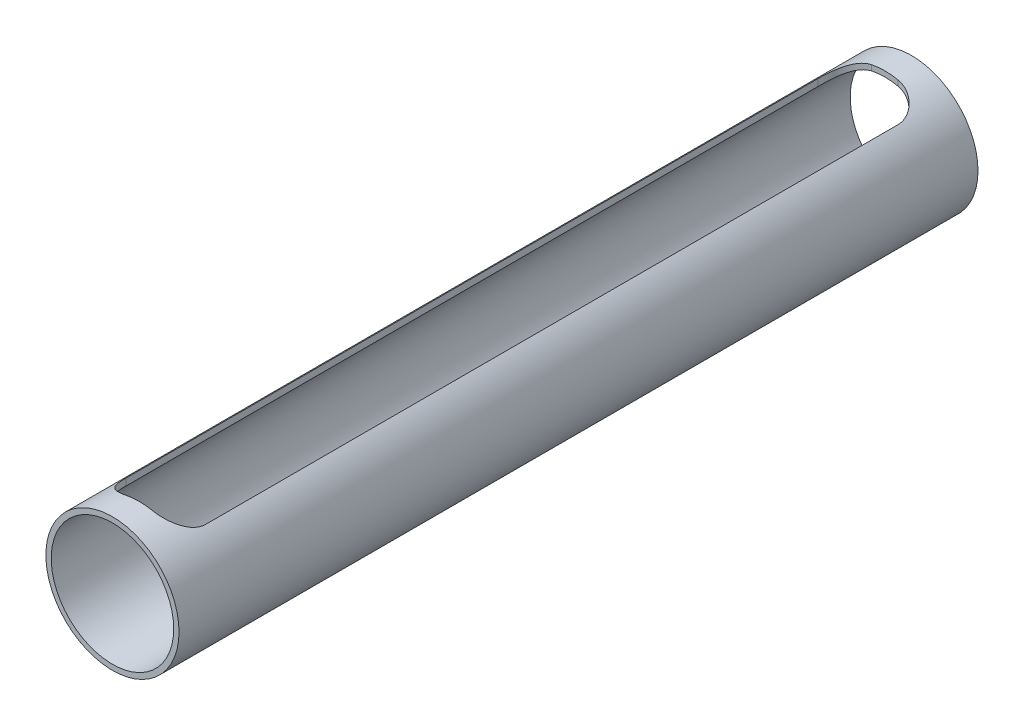
ISO-10303-21;
HEADER;
FILE_DESCRIPTION(('STEP AP214'),'2;1');
FILE_NAME('part.step','',(''),(''),'','','');
FILE_SCHEMA(('AUTOMOTIVE_DESIGN { 1 0 10303 214 1 1 1 1 }'));
ENDSEC;
DATA;
#1=APPLICATION_CONTEXT('core data for automotive mechanical design processes');
#2=APPLICATION_PROTOCOL_DEFINITION('international standard','automotive_design',2000,#1);
#3=PRODUCT_CONTEXT('',#1,'mechanical');
#4=PRODUCT('Part','Part','',(#3));
#5=PRODUCT_RELATED_PRODUCT_CATEGORY('part','',(#4));
#6=PRODUCT_DEFINITION_FORMATION('','',#4);
#7=PRODUCT_DEFINITION_CONTEXT('part definition',#1,'design');
#8=PRODUCT_DEFINITION('design','',#6,#7);
#9=PRODUCT_DEFINITION_SHAPE('','',#8);
#10=(LENGTH_UNIT() NAMED_UNIT(*) SI_UNIT(.MILLI.,.METRE.));
#11=(NAMED_UNIT(*) PLANE_ANGLE_UNIT() SI_UNIT($,.RADIAN.));
#12=(NAMED_UNIT(*) SI_UNIT($,.STERADIAN.) SOLID_ANGLE_UNIT());
#13=UNCERTAINTY_MEASURE_WITH_UNIT(LENGTH_MEASURE(1.E-05),#10,'distance_accuracy_value','');
#14=(GEOMETRIC_REPRESENTATION_CONTEXT(3) GLOBAL_UNCERTAINTY_ASSIGNED_CONTEXT((#13)) GLOBAL_UNIT_ASSIGNED_CONTEXT((#10,
#11,#12)) REPRESENTATION_CONTEXT('',''));
#15=CARTESIAN_POINT('',(0.,0.,0.));
#16=DIRECTION('',(0.,0.,1.));
#17=DIRECTION('',(1.,0.,0.));
#18=AXIS2_PLACEMENT_3D('',#15,#16,#17);
#19=CARTESIAN_POINT('',(0.,0.,300.));
#20=DIRECTION('',(0.,0.,1.));
#21=DIRECTION('',(1.,0.,0.));
#22=AXIS2_PLACEMENT_3D('',#19,#20,#21);
#23=PLANE('',#22);
#24=CARTESIAN_POINT('',(0.,0.,300.));
#25=DIRECTION('',(0.,0.,1.));
#26=DIRECTION('',(1.,0.,0.));
#27=AXIS2_PLACEMENT_3D('',#24,#25,#26);
#28=CIRCLE('',#27,25.);
#29=CARTESIAN_POINT('',(25.,0.,300.));
#30=VERTEX_POINT('',#29);
#31=EDGE_CURVE('E107',#30,#30,#28,.T.);
#32=ORIENTED_EDGE('',*,*,#31,.T.);
#33=EDGE_LOOP('',(#32));
#34=FACE_BOUND('',#33,.T.);
#35=CARTESIAN_POINT('',(0.,0.,300.));
#36=DIRECTION('',(0.,0.,1.));
#37=DIRECTION('',(1.,0.,0.));
#38=AXIS2_PLACEMENT_3D('',#35,#36,#37);
#39=CIRCLE('',#38,23.);
#40=CARTESIAN_POINT('',(23.,0.,300.));
#41=VERTEX_POINT('',#40);
#42=EDGE_CURVE('E167',#41,#41,#39,.T.);
#43=ORIENTED_EDGE('',*,*,#42,.F.);
#44=EDGE_LOOP('',(#43));
#45=FACE_BOUND('',#44,.T.);
#46=ADVANCED_FACE('F33',(#34,#45),#23,.T.);
#47=CARTESIAN_POINT('',(0.,0.,0.));
#48=DIRECTION('',(0.,0.,1.));
#49=DIRECTION('',(1.,0.,0.));
#50=AXIS2_PLACEMENT_3D('',#47,#48,#49);
#51=PLANE('',#50);
#52=CARTESIAN_POINT('',(0.,0.,0.));
#53=DIRECTION('',(0.,0.,1.));
#54=DIRECTION('',(1.,0.,0.));
#55=AXIS2_PLACEMENT_3D('',#52,#53,#54);
#56=CIRCLE('',#55,25.);
#57=CARTESIAN_POINT('',(25.,0.,0.));
#58=VERTEX_POINT('',#57);
#59=EDGE_CURVE('E260',#58,#58,#56,.T.);
#60=ORIENTED_EDGE('',*,*,#59,.F.);
#61=EDGE_LOOP('',(#60));
#62=FACE_BOUND('',#61,.T.);
#63=CARTESIAN_POINT('',(0.,0.,0.));
#64=DIRECTION('',(0.,0.,1.));
#65=DIRECTION('',(1.,0.,0.));
#66=AXIS2_PLACEMENT_3D('',#63,#64,#65);
#67=CIRCLE('',#66,23.);
#68=CARTESIAN_POINT('',(23.,0.,0.));
#69=VERTEX_POINT('',#68);
#70=EDGE_CURVE('E166',#69,#69,#67,.T.);
#71=ORIENTED_EDGE('',*,*,#70,.T.);
#72=EDGE_LOOP('',(#71));
#73=FACE_BOUND('',#72,.T.);
#74=ADVANCED_FACE('F249',(#62,#73),#51,.F.);
#75=CARTESIAN_POINT('',(0.,0.,300.));
#76=DIRECTION('',(0.,0.,-1.));
#77=DIRECTION('',(-1.,0.,0.));
#78=AXIS2_PLACEMENT_3D('',#75,#76,#77);
#79=CYLINDRICAL_SURFACE('',#78,25.);
#80=CARTESIAN_POINT('',(0.,0.,10.));
#81=DIRECTION('',(0.,0.,-1.));
#82=DIRECTION('',(-1.,0.,0.));
#83=AXIS2_PLACEMENT_3D('',#80,#81,#82);
#84=CIRCLE('',#83,25.);
#85=CARTESIAN_POINT('',(-5.00000000000002,24.4948974278318,10.));
#86=VERTEX_POINT('',#85);
#87=CARTESIAN_POINT('',(5.00000000000002,24.4948974278318,10.));
#88=VERTEX_POINT('',#87);
#89=EDGE_CURVE('E198',#86,#88,#84,.T.);
#90=ORIENTED_EDGE('',*,*,#89,.T.);
#91=CARTESIAN_POINT('',(5.00000000000002,24.4948974278318,10.));
#92=CARTESIAN_POINT('',(5.14303837233241,24.4657016129685,9.99999958017287));
#93=CARTESIAN_POINT('',(5.28579840553904,24.4352535390066,10.0030694771409));
#94=CARTESIAN_POINT('',(5.57050621819225,24.3719247231988,10.0152703718325));
#95=CARTESIAN_POINT('',(5.71245406147975,24.3390441754643,10.0244008863814));
#96=CARTESIAN_POINT('',(6.1364918362658,24.2369116953102,10.0607443924561));
#97=CARTESIAN_POINT('',(6.41701786765221,24.1641194908536,10.0969096213806));
#98=CARTESIAN_POINT('',(6.9703174317055,24.0103473454274,10.1920284836991));
#99=CARTESIAN_POINT('',(7.24312200483371,23.9294088971209,10.2508705608199));
#100=CARTESIAN_POINT('',(7.78073976953116,23.7600404327401,10.3903894782287));
#101=CARTESIAN_POINT('',(8.04555184459905,23.6716093765051,10.4710693535707));
#102=CARTESIAN_POINT('',(8.5649701353708,23.4886552534443,10.6529935944866));
#103=CARTESIAN_POINT('',(8.81960081416304,23.3941484146467,10.7541846165521));
#104=CARTESIAN_POINT('',(9.31822803392014,23.2000482701,10.976284966447));
#105=CARTESIAN_POINT('',(9.56221989418785,23.1004527665486,11.097202864643));
#106=CARTESIAN_POINT('',(10.0386939069366,22.8974186874217,11.3579273914724));
#107=CARTESIAN_POINT('',(10.271160035536,22.7939750931414,11.4977593622102));
#108=CARTESIAN_POINT('',(10.7232829853869,22.584801468626,11.7952893102386));
#109=CARTESIAN_POINT('',(10.9429390272002,22.4790712997983,11.9529883729498));
#110=CARTESIAN_POINT('',(11.3860163262992,22.2581406296398,12.2990800013817));
#111=CARTESIAN_POINT('',(11.6082690760545,22.1428745609543,12.4889291089619));
#112=CARTESIAN_POINT('',(12.03566002025,21.9135054184813,12.8876923888925));
#113=CARTESIAN_POINT('',(12.2407963967709,21.7994024693548,13.0966085814246));
#114=CARTESIAN_POINT('',(12.6327218282886,21.5746461209196,13.5325853240966));
#115=CARTESIAN_POINT('',(12.8195167910652,21.4639916187552,13.7596399888058));
#116=CARTESIAN_POINT('',(13.1735981336548,21.248512130273,14.2311853933548));
#117=CARTESIAN_POINT('',(13.3408815583788,21.1436880282438,14.4756787653334));
#118=CARTESIAN_POINT('',(13.6293552345481,20.9586540257833,14.9406866128472));
#119=CARTESIAN_POINT('',(13.7536389836998,20.8771880927823,15.1587863292708));
#120=CARTESIAN_POINT('',(13.9864094522994,20.7219671002349,15.6059182509894));
#121=CARTESIAN_POINT('',(14.0948968058377,20.6482117312086,15.8349500169656));
#122=CARTESIAN_POINT('',(14.2947752278168,20.5103417158092,16.3024827900333));
#123=CARTESIAN_POINT('',(14.38620646402,20.446204490122,16.5409599036878));
#124=CARTESIAN_POINT('',(14.5511580590982,20.3291426508016,17.0266047122386));
#125=CARTESIAN_POINT('',(14.6246880203533,20.2762120278564,17.2737676661968));
#126=CARTESIAN_POINT('',(14.7396957126372,20.1927048502555,17.7238881378177));
#127=CARTESIAN_POINT('',(14.784653879181,20.1597701812266,17.9255259764396));
#128=CARTESIAN_POINT('',(14.8621451451004,20.1027099666487,18.3323772713636));
#129=CARTESIAN_POINT('',(14.8946810100734,20.0785824603993,18.5375899211495));
#130=CARTESIAN_POINT('',(14.9470909281765,20.0396010515749,18.9516159614858));
#131=CARTESIAN_POINT('',(14.9668972876382,20.0247967366297,19.1604426354732));
#132=CARTESIAN_POINT('',(14.9933699774573,20.0049720004956,19.5795054223523));
#133=CARTESIAN_POINT('',(15.0000288297816,19.9999571473706,19.7897422691546));
#134=CARTESIAN_POINT('',(15.,20.,20.));
#135=B_SPLINE_CURVE_WITH_KNOTS('',3,(#91,#92,#93,#94,#95,#96,#97,#98,#99,#100,#101,#102,#103,
#104,#105,#106,#107,#108,#109,#110,#111,#112,#113,#114,#115,#116,#117,#118,#119,#120,#121,#122,
#123,#124,#125,#126,#127,#128,#129,#130,#131,#132,#133,#134),.UNSPECIFIED.,.F.,.F.,(4,2,2,2,2,2,
2,2,2,2,2,2,2,2,2,2,2,2,2,2,2,4),(0.,0.437882162683755,0.875729419986846,1.75068606058833,
2.62139228664386,3.49221958710982,4.36081052651778,5.22977983623795,6.09992518940482,
6.97012343202207,7.91168569841341,8.8533478405804,9.79470567096022,10.7362058885792,
11.5271988598179,12.3181600706838,13.1072343513313,13.8958844293072,14.5229334609037,
15.1498428100273,15.7800589748626,16.4106334906159),.UNSPECIFIED.);
#136=CARTESIAN_POINT('',(15.,20.,20.));
#137=VERTEX_POINT('',#136);
#138=EDGE_CURVE('E114',#88,#137,#135,.T.);
#139=ORIENTED_EDGE('',*,*,#138,.T.);
#140=DIRECTION('',(0.,0.,-1.));
#141=VECTOR('',#140,1.);
#142=CARTESIAN_POINT('',(15.,20.,300.));
#143=LINE('',#142,#141);
#144=CARTESIAN_POINT('',(15.,20.,280.));
#145=VERTEX_POINT('',#144);
#146=EDGE_CURVE('E156',#137,#145,#143,.F.);
#147=ORIENTED_EDGE('',*,*,#146,.T.);
#148=CARTESIAN_POINT('',(15.,20.,280.));
#149=CARTESIAN_POINT('',(15.0000014145047,19.9999968954437,280.124721484722));
#150=CARTESIAN_POINT('',(14.9976660979272,20.0017506712033,280.249424248617));
#151=CARTESIAN_POINT('',(14.9883423273526,20.0087391873832,280.498551168648));
#152=CARTESIAN_POINT('',(14.9813541343986,20.0139737325199,280.622975340022));
#153=CARTESIAN_POINT('',(14.9534600064335,20.0348349160065,280.995226677234));
#154=CARTESIAN_POINT('',(14.9256244295562,20.0556192418498,281.242297389089));
#155=CARTESIAN_POINT('',(14.8522215222555,20.1100363728512,281.730380253627));
#156=CARTESIAN_POINT('',(14.8067884510388,20.1435718589834,281.971423909512));
#157=CARTESIAN_POINT('',(14.6988821377204,20.2224460678486,282.447717962918));
#158=CARTESIAN_POINT('',(14.6364062166432,20.26778664618,282.682967443306));
#159=CARTESIAN_POINT('',(14.4954772870136,20.3688146356706,283.145500126849));
#160=CARTESIAN_POINT('',(14.417074611833,20.4244694034313,283.372805845804));
#161=CARTESIAN_POINT('',(14.2451104877818,20.5447769323076,283.819053948814));
#162=CARTESIAN_POINT('',(14.1515493318394,20.6094295195423,284.037996494382));
#163=CARTESIAN_POINT('',(13.8490123306613,20.8149989591605,284.68186215836));
#164=CARTESIAN_POINT('',(13.6183547449344,20.9674004431704,285.093268198047));
#165=CARTESIAN_POINT('',(13.2206342793677,21.2189326600331,285.699849481737));
#166=CARTESIAN_POINT('',(13.0710400281106,21.3115359078307,285.909681012195));
#167=CARTESIAN_POINT('',(12.7571019781919,21.5009281709953,286.316108149362));
#168=CARTESIAN_POINT('',(12.5927576811342,21.5977173277446,286.512703308429));
#169=CARTESIAN_POINT('',(12.2501211772858,21.7938875059866,286.892107292262));
#170=CARTESIAN_POINT('',(12.0718222079174,21.8932697683783,287.074909347412));
#171=CARTESIAN_POINT('',(11.7020973667655,22.0931002575379,287.42609542984));
#172=CARTESIAN_POINT('',(11.5106709367638,22.1935485294819,287.594478843309));
#173=CARTESIAN_POINT('',(11.0839849175088,22.4100697123571,287.941810412376));
#174=CARTESIAN_POINT('',(10.8465943677183,22.5260884083215,288.118183832296));
#175=CARTESIAN_POINT('',(10.3562781588829,22.7556760959751,288.44972633024));
#176=CARTESIAN_POINT('',(10.1033506365082,22.8692447916234,288.604892857723));
#177=CARTESIAN_POINT('',(9.58349049831765,23.0919158359936,288.892681515329));
#178=CARTESIAN_POINT('',(9.3165729524784,23.2010227741116,289.025327277087));
#179=CARTESIAN_POINT('',(8.76993052845609,23.4131209147418,289.266978795728));
#180=CARTESIAN_POINT('',(8.49020758688139,23.5161130366448,289.37598811303));
#181=CARTESIAN_POINT('',(7.95185215743926,23.7031608989012,289.55813511297));
#182=CARTESIAN_POINT('',(7.694404511469,23.7880417265185,289.633933357018));
#183=CARTESIAN_POINT('',(7.17216353122691,23.9506758371819,289.764945875837));
#184=CARTESIAN_POINT('',(6.90737174964135,24.0284306120687,289.820164466421));
#185=CARTESIAN_POINT('',(6.37106946940391,24.1761645896727,289.909301406677));
#186=CARTESIAN_POINT('',(6.09953903304292,24.246116194249,289.943146012568));
#187=CARTESIAN_POINT('',(5.55235113673325,24.3772676477746,289.988518723356));
#188=CARTESIAN_POINT('',(5.27669112467908,24.4384618153911,290.000032401445));
#189=CARTESIAN_POINT('',(5.00000000000006,24.4948974278318,290.));
#190=B_SPLINE_CURVE_WITH_KNOTS('',3,(#148,#149,#150,#151,#152,#153,#154,#155,#156,#157,#158,
#159,#160,#161,#162,#163,#164,#165,#166,#167,#168,#169,#170,#171,#172,#173,#174,#175,#176,#177,
#178,#179,#180,#181,#182,#183,#184,#185,#186,#187,#188,#189),.UNSPECIFIED.,.F.,.F.,(4,2,2,2,2,2,
2,2,2,2,2,2,2,2,2,2,2,2,2,2,4),(0.,0.374093401240721,0.748165816273225,1.49551959520637,
2.23728035614158,2.97915778214376,3.71872613996171,4.45828020778205,5.93915461910859,
6.76007622284715,7.58102557553641,8.40237526186057,9.22375989607038,10.1756993590541,
11.1277532106871,12.0788017884474,13.0297070076515,13.8732439347355,14.7166038618517,
15.5628578483541,16.409658372012),.UNSPECIFIED.);
#191=CARTESIAN_POINT('',(5.00000000000006,24.4948974278318,290.));
#192=VERTEX_POINT('',#191);
#193=EDGE_CURVE('E148',#145,#192,#190,.T.);
#194=ORIENTED_EDGE('',*,*,#193,.T.);
#195=CARTESIAN_POINT('',(0.,0.,290.));
#196=DIRECTION('',(0.,0.,1.));
#197=DIRECTION('',(1.,0.,0.));
#198=AXIS2_PLACEMENT_3D('',#195,#196,#197);
#199=CIRCLE('',#198,25.);
#200=CARTESIAN_POINT('',(-4.99999999999996,24.4948974278318,290.));
#201=VERTEX_POINT('',#200);
#202=EDGE_CURVE('E157',#192,#201,#199,.T.);
#203=ORIENTED_EDGE('',*,*,#202,.T.);
#204=CARTESIAN_POINT('',(-4.99999999999996,24.4948974278318,290.));
#205=CARTESIAN_POINT('',(-5.14303837233234,24.4657016129685,290.000000419827));
#206=CARTESIAN_POINT('',(-5.28579840553897,24.4352535390066,289.996930522859));
#207=CARTESIAN_POINT('',(-5.57050621819218,24.3719247231988,289.984729628168));
#208=CARTESIAN_POINT('',(-5.71245406147968,24.3390441754643,289.975599113619));
#209=CARTESIAN_POINT('',(-6.13649183626573,24.2369116953102,289.939255607544));
#210=CARTESIAN_POINT('',(-6.41701786765214,24.1641194908537,289.903090378619));
#211=CARTESIAN_POINT('',(-6.97031743170543,24.0103473454275,289.807971516301));
#212=CARTESIAN_POINT('',(-7.24312200483364,23.9294088971209,289.74912943918));
#213=CARTESIAN_POINT('',(-7.78073976953109,23.7600404327401,289.609610521771));
#214=CARTESIAN_POINT('',(-8.04555184459897,23.6716093765051,289.528930646429));
#215=CARTESIAN_POINT('',(-8.56497013537073,23.4886552534443,289.347006405513));
#216=CARTESIAN_POINT('',(-8.81960081416298,23.3941484146467,289.245815383448));
#217=CARTESIAN_POINT('',(-9.31822803392007,23.2000482701,289.023715033553));
#218=CARTESIAN_POINT('',(-9.56221989418776,23.1004527665486,288.902797135357));
#219=CARTESIAN_POINT('',(-10.0386939069365,22.8974186874217,288.642072608528));
#220=CARTESIAN_POINT('',(-10.2711600355359,22.7939750931414,288.50224063779));
#221=CARTESIAN_POINT('',(-10.7232829853868,22.5848014686261,288.204710689761));
#222=CARTESIAN_POINT('',(-10.9429390272001,22.4790712997983,288.04701162705));
#223=CARTESIAN_POINT('',(-11.3860163262991,22.2581406296398,287.700919998618));
#224=CARTESIAN_POINT('',(-11.6082690760545,22.1428745609544,287.511070891038));
#225=CARTESIAN_POINT('',(-12.0356600202499,21.9135054184813,287.112307611107));
#226=CARTESIAN_POINT('',(-12.2407963967708,21.7994024693549,286.903391418575));
#227=CARTESIAN_POINT('',(-12.6327218282885,21.5746461209197,286.467414675903));
#228=CARTESIAN_POINT('',(-12.8195167910651,21.4639916187552,286.240360011194));
#229=CARTESIAN_POINT('',(-13.1735981336547,21.2485121302731,285.768814606645));
#230=CARTESIAN_POINT('',(-13.3408815583787,21.1436880282438,285.524321234667));
#231=CARTESIAN_POINT('',(-13.6293552345481,20.9586540257833,285.059313387153));
#232=CARTESIAN_POINT('',(-13.7536389836998,20.8771880927824,284.841213670729));
#233=CARTESIAN_POINT('',(-13.9864094522993,20.7219671002349,284.394081749011));
#234=CARTESIAN_POINT('',(-14.0948968058376,20.6482117312086,284.165049983034));
#235=CARTESIAN_POINT('',(-14.2947752278167,20.5103417158093,283.697517209967));
#236=CARTESIAN_POINT('',(-14.38620646402,20.446204490122,283.459040096312));
#237=CARTESIAN_POINT('',(-14.5511580590982,20.3291426508016,282.973395287761));
#238=CARTESIAN_POINT('',(-14.6246880203533,20.2762120278565,282.726232333803));
#239=CARTESIAN_POINT('',(-14.7396957126371,20.1927048502556,282.276111862182));
#240=CARTESIAN_POINT('',(-14.7846538791809,20.1597701812266,282.07447402356));
#241=CARTESIAN_POINT('',(-14.8621451451003,20.1027099666488,281.667622728636));
#242=CARTESIAN_POINT('',(-14.8946810100733,20.0785824603993,281.46241007885));
#243=CARTESIAN_POINT('',(-14.9470909281765,20.039601051575,281.048384038514));
#244=CARTESIAN_POINT('',(-14.9668972876381,20.0247967366298,280.839557364527));
#245=CARTESIAN_POINT('',(-14.9933699774572,20.0049720004957,280.420494577648));
#246=CARTESIAN_POINT('',(-15.0000288297815,19.9999571473707,280.210257730845));
#247=CARTESIAN_POINT('',(-15.,20.,280.));
#248=B_SPLINE_CURVE_WITH_KNOTS('',3,(#204,#205,#206,#207,#208,#209,#210,#211,#212,#213,#214,
#215,#216,#217,#218,#219,#220,#221,#222,#223,#224,#225,#226,#227,#228,#229,#230,#231,#232,#233,
#234,#235,#236,#237,#238,#239,#240,#241,#242,#243,#244,#245,#246,#247),.UNSPECIFIED.,.F.,.F.,(4,
2,2,2,2,2,2,2,2,2,2,2,2,2,2,2,2,2,2,2,2,4),(0.,0.437882162683753,0.87572941998684,
1.75068606058833,2.62139228664385,3.4922195871098,4.36081052651777,5.22977983623792,
6.09992518940479,6.97012343202205,7.91168569841339,8.8533478405804,9.79470567096016,
10.7362058885792,11.5271988598178,12.3181600706838,13.1072343513314,13.8958844293072,
14.5229334609037,15.1498428100272,15.7800589748626,16.4106334906159),.UNSPECIFIED.);
#249=CARTESIAN_POINT('',(-15.,20.,280.));
#250=VERTEX_POINT('',#249);
#251=EDGE_CURVE('E200',#201,#250,#248,.T.);
#252=ORIENTED_EDGE('',*,*,#251,.T.);
#253=DIRECTION('',(0.,0.,-1.));
#254=VECTOR('',#253,1.);
#255=CARTESIAN_POINT('',(-15.,20.,300.));
#256=LINE('',#255,#254);
#257=CARTESIAN_POINT('',(-15.,20.,20.));
#258=VERTEX_POINT('',#257);
#259=EDGE_CURVE('E197',#250,#258,#256,.T.);
#260=ORIENTED_EDGE('',*,*,#259,.T.);
#261=CARTESIAN_POINT('',(-15.,20.,20.));
#262=CARTESIAN_POINT('',(-15.0000014145047,19.9999968954437,19.8752785152775));
#263=CARTESIAN_POINT('',(-14.9976660979272,20.0017506712033,19.7505757513829));
#264=CARTESIAN_POINT('',(-14.9883423273526,20.0087391873832,19.5014488313519));
#265=CARTESIAN_POINT('',(-14.9813541343986,20.0139737325199,19.3770246599784));
#266=CARTESIAN_POINT('',(-14.9534600064335,20.0348349160065,19.0047733227659));
#267=CARTESIAN_POINT('',(-14.9256244295562,20.0556192418498,18.7577026109109));
#268=CARTESIAN_POINT('',(-14.8522215222555,20.1100363728513,18.2696197463729));
#269=CARTESIAN_POINT('',(-14.8067884510387,20.1435718589834,18.028576090488));
#270=CARTESIAN_POINT('',(-14.6988821377204,20.2224460678486,17.5522820370816));
#271=CARTESIAN_POINT('',(-14.6364062166432,20.26778664618,17.317032556694));
#272=CARTESIAN_POINT('',(-14.4954772870136,20.3688146356706,16.8544998731513));
#273=CARTESIAN_POINT('',(-14.4170746118331,20.4244694034313,16.6271941541963));
#274=CARTESIAN_POINT('',(-14.2451104877818,20.5447769323075,16.1809460511856));
#275=CARTESIAN_POINT('',(-14.1515493318394,20.6094295195423,15.9620035056179));
#276=CARTESIAN_POINT('',(-13.8490123306613,20.8149989591605,15.3181378416403));
#277=CARTESIAN_POINT('',(-13.6183547449344,20.9674004431704,14.9067318019528));
#278=CARTESIAN_POINT('',(-13.2206342793677,21.2189326600331,14.3001505182631));
#279=CARTESIAN_POINT('',(-13.0710400281106,21.3115359078307,14.090318987805));
#280=CARTESIAN_POINT('',(-12.7571019781919,21.5009281709953,13.6838918506377));
#281=CARTESIAN_POINT('',(-12.5927576811342,21.5977173277446,13.4872966915715));
#282=CARTESIAN_POINT('',(-12.2501211772858,21.7938875059866,13.1078927077383));
#283=CARTESIAN_POINT('',(-12.0718222079174,21.8932697683783,12.9250906525885));
#284=CARTESIAN_POINT('',(-11.7020973667654,22.0931002575379,12.5739045701604));
#285=CARTESIAN_POINT('',(-11.5106709367637,22.1935485294819,12.4055211566906));
#286=CARTESIAN_POINT('',(-11.0839849175088,22.4100697123571,12.0581895876242));
#287=CARTESIAN_POINT('',(-10.8465943677183,22.5260884083215,11.881816167704));
#288=CARTESIAN_POINT('',(-10.3562781588829,22.7556760959751,11.5502736697599));
#289=CARTESIAN_POINT('',(-10.1033506365082,22.8692447916234,11.3951071422766));
#290=CARTESIAN_POINT('',(-9.58349049831768,23.0919158359936,11.1073184846709));
#291=CARTESIAN_POINT('',(-9.31657295247842,23.2010227741116,10.9746727229134));
#292=CARTESIAN_POINT('',(-8.7699305284561,23.4131209147418,10.7330212042719));
#293=CARTESIAN_POINT('',(-8.4902075868814,23.5161130366448,10.6240118869698));
#294=CARTESIAN_POINT('',(-7.95185215743926,23.7031608989012,10.4418648870301));
#295=CARTESIAN_POINT('',(-7.694404511469,23.7880417265185,10.3660666429823));
#296=CARTESIAN_POINT('',(-7.1721635312269,23.9506758371819,10.2350541241625));
#297=CARTESIAN_POINT('',(-6.90737174964134,24.0284306120687,10.1798355335785));
#298=CARTESIAN_POINT('',(-6.3710694694039,24.1761645896727,10.0906985933231));
#299=CARTESIAN_POINT('',(-6.0995390330429,24.246116194249,10.056853987432));
#300=CARTESIAN_POINT('',(-5.55235113673322,24.3772676477746,10.0114812766441));
#301=CARTESIAN_POINT('',(-5.27669112467905,24.4384618153912,9.99996759855464));
#302=CARTESIAN_POINT('',(-5.00000000000002,24.4948974278318,10.));
#303=B_SPLINE_CURVE_WITH_KNOTS('',3,(#261,#262,#263,#264,#265,#266,#267,#268,#269,#270,#271,
#272,#273,#274,#275,#276,#277,#278,#279,#280,#281,#282,#283,#284,#285,#286,#287,#288,#289,#290,
#291,#292,#293,#294,#295,#296,#297,#298,#299,#300,#301,#302),.UNSPECIFIED.,.F.,.F.,(4,2,2,2,2,2,
2,2,2,2,2,2,2,2,2,2,2,2,2,2,4),(0.,0.374093401240704,0.748165816273246,1.49551959520638,
2.23728035614166,2.97915778214377,3.71872613996172,4.45828020778205,5.93915461910863,
6.76007622284714,7.58102557553641,8.40237526186064,9.2237598960704,10.1756993590541,
11.1277532106871,12.0788017884474,13.0297070076515,13.8732439347355,14.7166038618517,
15.5628578483542,16.409658372012),.UNSPECIFIED.);
#304=EDGE_CURVE('E189',#258,#86,#303,.T.);
#305=ORIENTED_EDGE('',*,*,#304,.T.);
#306=EDGE_LOOP('',(#90,#139,#147,#194,#203,#252,#260,#305));
#307=FACE_BOUND('',#306,.T.);
#308=ORIENTED_EDGE('',*,*,#31,.F.);
#309=EDGE_LOOP('',(#308));
#310=FACE_BOUND('',#309,.T.);
#311=ORIENTED_EDGE('',*,*,#59,.T.);
#312=EDGE_LOOP('',(#311));
#313=FACE_BOUND('',#312,.T.);
#314=ADVANCED_FACE('F35',(#307,#310,#313),#79,.T.);
#315=CARTESIAN_POINT('',(0.,0.,300.));
#316=DIRECTION('',(0.,0.,-1.));
#317=DIRECTION('',(-1.,0.,0.));
#318=AXIS2_PLACEMENT_3D('',#315,#316,#317);
#319=CYLINDRICAL_SURFACE('',#318,23.);
#320=CARTESIAN_POINT('',(5.00000000000002,22.4499443206436,10.));
#321=CARTESIAN_POINT('',(5.14322806606658,22.4180468365861,9.99999947720065));
#322=CARTESIAN_POINT('',(5.28612731464498,22.3847795930126,10.0030776225678));
#323=CARTESIAN_POINT('',(5.57100806670452,22.3155851852869,10.0152978454302));
#324=CARTESIAN_POINT('',(5.71298964332182,22.279658236021,10.0244394335137));
#325=CARTESIAN_POINT('',(6.13693451854855,22.1680696522814,10.0607970619672));
#326=CARTESIAN_POINT('',(6.41717020509057,22.0885395655717,10.0969463291319));
#327=CARTESIAN_POINT('',(6.96926091654986,21.9205897566977,10.1918364030236));
#328=CARTESIAN_POINT('',(7.2411537474576,21.8322216832967,10.2504510389709));
#329=CARTESIAN_POINT('',(7.7765678735757,21.6472911625718,10.3892165842508));
#330=CARTESIAN_POINT('',(8.04008778303085,21.5507273684292,10.4693710379696));
#331=CARTESIAN_POINT('',(8.55655397698916,21.350921583444,10.6498366587532));
#332=CARTESIAN_POINT('',(8.80952772225908,21.2476989856439,10.7500909383594));
#333=CARTESIAN_POINT('',(9.30451561561443,21.0356480194538,10.9698023685483));
#334=CARTESIAN_POINT('',(9.54653018106044,20.9268198648791,11.0892587870627));
#335=CARTESIAN_POINT('',(10.0190767202326,20.7047430029575,11.3465969166121));
#336=CARTESIAN_POINT('',(10.2495872243228,20.5914866857261,11.4845114306693));
#337=CARTESIAN_POINT('',(10.6978478841498,20.3622062170904,11.7776970618514));
#338=CARTESIAN_POINT('',(10.9155970742526,20.2461818571638,11.9329694898515));
#339=CARTESIAN_POINT('',(11.3584729851724,20.0013816573681,12.276276804944));
#340=CARTESIAN_POINT('',(11.582198098801,19.8724799532528,12.4660332268293));
#341=CARTESIAN_POINT('',(12.0123951280996,19.6154317471866,12.8647120205124));
#342=CARTESIAN_POINT('',(12.218864843415,19.48728534348,13.073636829499));
#343=CARTESIAN_POINT('',(12.6134979857007,19.2342042498092,13.5099175568031));
#344=CARTESIAN_POINT('',(12.801661807738,19.1092694905761,13.7372730771657));
#345=CARTESIAN_POINT('',(13.1584775997938,18.8653425805317,14.2097625528571));
#346=CARTESIAN_POINT('',(13.3271338518668,18.7463491288315,14.4548925872567));
#347=CARTESIAN_POINT('',(13.6142621767618,18.5385335000168,14.9153305216911));
#348=CARTESIAN_POINT('',(13.7362471826369,18.4482009171306,15.1277715268541));
#349=CARTESIAN_POINT('',(13.965456045069,18.2753016158216,15.5636462590781));
#350=CARTESIAN_POINT('',(14.0726751698365,18.1927373894743,15.7870834789322));
#351=CARTESIAN_POINT('',(14.2709376852598,18.0376312314278,16.2434831625597));
#352=CARTESIAN_POINT('',(14.362031076308,17.965058480875,16.4764133266545));
#353=CARTESIAN_POINT('',(14.5272742664186,17.8317016632214,16.9513614998087));
#354=CARTESIAN_POINT('',(14.6014348078537,17.7709101257222,17.1933736330534));
#355=CARTESIAN_POINT('',(14.7208442625772,17.6720602251112,17.644133628682));
#356=CARTESIAN_POINT('',(14.7688527023747,17.6319011023463,17.8516923264025));
#357=CARTESIAN_POINT('',(14.8517361546374,17.5621426531026,18.2711317802721));
#358=CARTESIAN_POINT('',(14.8866145244765,17.5325406272641,18.4830114169247));
#359=CARTESIAN_POINT('',(14.9429440696304,17.4845614154483,18.9114929113066));
#360=CARTESIAN_POINT('',(14.9642903726048,17.4662719265124,19.1281185062841));
#361=CARTESIAN_POINT('',(14.9928442595463,17.441751279661,19.563150176147));
#362=CARTESIAN_POINT('',(15.0000403055018,17.4355299620963,19.7815575583136));
#363=CARTESIAN_POINT('',(15.,17.4355957741627,20.));
#364=B_SPLINE_CURVE_WITH_KNOTS('',3,(#320,#321,#322,#323,#324,#325,#326,#327,#328,#329,#330,
#331,#332,#333,#334,#335,#336,#337,#338,#339,#340,#341,#342,#343,#344,#345,#346,#347,#348,#349,
#350,#351,#352,#353,#354,#355,#356,#357,#358,#359,#360,#361,#362,#363),.UNSPECIFIED.,.F.,.F.,(4,
2,2,2,2,2,2,2,2,2,2,2,2,2,2,2,2,2,2,2,2,4),(0.,0.440127632550676,0.880219744460037,
1.75957027719973,2.63405287304671,3.50867945358364,4.38086470962537,5.25301672208411,
6.12673979726054,7.0005289009224,7.96076987492047,8.92113310962065,9.8814756137307,
10.8416069139599,11.6242020534258,12.4070473981606,13.1874211882474,13.9672985170741,
14.6170212807454,15.2665777965386,15.921108683322,16.5761730486592),.UNSPECIFIED.);
#365=CARTESIAN_POINT('',(5.00000000000002,22.4499443206436,10.));
#366=VERTEX_POINT('',#365);
#367=CARTESIAN_POINT('',(15.,17.4355957741627,20.));
#368=VERTEX_POINT('',#367);
#369=EDGE_CURVE('E11',#366,#368,#364,.T.);
#370=ORIENTED_EDGE('',*,*,#369,.F.);
#371=CARTESIAN_POINT('',(0.,0.,10.));
#372=DIRECTION('',(0.,0.,-1.));
#373=DIRECTION('',(-1.,0.,0.));
#374=AXIS2_PLACEMENT_3D('',#371,#372,#373);
#375=CIRCLE('',#374,23.);
#376=CARTESIAN_POINT('',(-5.00000000000002,22.4499443206436,10.));
#377=VERTEX_POINT('',#376);
#378=EDGE_CURVE('E101',#377,#366,#375,.T.);
#379=ORIENTED_EDGE('',*,*,#378,.F.);
#380=CARTESIAN_POINT('',(-15.,17.4355957741627,20.));
#381=CARTESIAN_POINT('',(-15.0000017091664,17.4355919366086,19.8783793356473));
#382=CARTESIAN_POINT('',(-14.9977806517384,17.4375053768805,19.7567780364745));
#383=CARTESIAN_POINT('',(-14.9889158669831,17.4451268618289,19.5138645278552));
#384=CARTESIAN_POINT('',(-14.9822724623874,17.450834629605,19.3925522979614));
#385=CARTESIAN_POINT('',(-14.9557652550157,17.4735704367663,19.029709134699));
#386=CARTESIAN_POINT('',(-14.9293243318631,17.4962111871024,18.7889579661936));
#387=CARTESIAN_POINT('',(-14.8597253664448,17.5553582315239,18.3138855270131));
#388=CARTESIAN_POINT('',(-14.8167170478276,17.5917402861449,18.0795262451186));
#389=CARTESIAN_POINT('',(-14.7147180171693,17.6771460444329,17.6166331089225));
#390=CARTESIAN_POINT('',(-14.6557239631722,17.7261723913949,17.3881004836762));
#391=CARTESIAN_POINT('',(-14.5229061985888,17.8351484810827,16.9391448035511));
#392=CARTESIAN_POINT('',(-14.449143676672,17.8950530609006,16.7186925876585));
#393=CARTESIAN_POINT('',(-14.2875826637985,18.0243088381984,16.2859456604404));
#394=CARTESIAN_POINT('',(-14.199784578474,18.0936597626673,16.0736507135872));
#395=CARTESIAN_POINT('',(-13.9161664266085,18.3138595544743,15.4490463172607));
#396=CARTESIAN_POINT('',(-13.7003425406649,18.4766691901039,15.0497478759422));
#397=CARTESIAN_POINT('',(-13.3262640446182,18.7466943660871,14.4558457916723));
#398=CARTESIAN_POINT('',(-13.1838392522189,18.8472637553141,14.2477935320899));
#399=CARTESIAN_POINT('',(-12.8848588358649,19.0529074842772,13.84435436317));
#400=CARTESIAN_POINT('',(-12.7283025908751,19.1579820218944,13.6489680111104));
#401=CARTESIAN_POINT('',(-12.4017697004018,19.3709612112072,13.2712417573173));
#402=CARTESIAN_POINT('',(-12.2317864290892,19.4788672423976,13.0889083825026));
#403=CARTESIAN_POINT('',(-11.8791038384097,19.6959329550439,12.7377795183999));
#404=CARTESIAN_POINT('',(-11.6964038301623,19.8050927041474,12.5689847635826));
#405=CARTESIAN_POINT('',(-11.2813918414953,20.0449106655269,12.213286937464));
#406=CARTESIAN_POINT('',(-11.0464303380536,20.1755355050253,12.029439537361));
#407=CARTESIAN_POINT('',(-10.5600783748821,20.4343005109163,11.6828670870194));
#408=CARTESIAN_POINT('',(-10.3086857870571,20.562440352663,11.5201447810099));
#409=CARTESIAN_POINT('',(-9.79088820539871,20.8139674840364,11.2172191129639));
#410=CARTESIAN_POINT('',(-9.52450188682698,20.9373603770622,11.0769885398979));
#411=CARTESIAN_POINT('',(-8.97771895015136,21.177575502073,10.8201873477738));
#412=CARTESIAN_POINT('',(-8.69732337000598,21.2943982194889,10.7036149790885));
#413=CARTESIAN_POINT('',(-8.14415549268435,21.5117351537989,10.5029121070349));
#414=CARTESIAN_POINT('',(-7.87222430561957,21.6128185331565,10.4170814693329));
#415=CARTESIAN_POINT('',(-7.31919629156526,21.8063102034494,10.2684381547044));
#416=CARTESIAN_POINT('',(-7.03810161549863,21.8987205107181,10.2056201178533));
#417=CARTESIAN_POINT('',(-6.46711855813054,22.0741009756316,10.103939739683));
#418=CARTESIAN_POINT('',(-6.17719429061132,22.1570234320811,10.0651944496622));
#419=CARTESIAN_POINT('',(-5.73837984104386,22.2731670630948,10.026213660572));
#420=CARTESIAN_POINT('',(-5.5913725529994,22.3105263612555,10.0164094716009));
#421=CARTESIAN_POINT('',(-5.29636148000159,22.3823953113011,10.0033020348229));
#422=CARTESIAN_POINT('',(-5.14835760601523,22.4169047048278,9.99999937579401));
#423=CARTESIAN_POINT('',(-5.00000000000002,22.4499443206436,10.));
#424=B_SPLINE_CURVE_WITH_KNOTS('',3,(#380,#381,#382,#383,#384,#385,#386,#387,#388,#389,#390,
#391,#392,#393,#394,#395,#396,#397,#398,#399,#400,#401,#402,#403,#404,#405,#406,#407,#408,#409,
#410,#411,#412,#413,#414,#415,#416,#417,#418,#419,#420,#421,#422,#423),.UNSPECIFIED.,.F.,.F.,(4,
2,2,2,2,2,2,2,2,2,2,2,2,2,2,2,2,2,2,2,2,4),(0.,0.364788666404088,0.729550714387498,
1.45813743174425,2.1802886119673,2.90259088076028,3.62196023293095,4.34130879885847,
5.78233888384759,6.59615382307001,7.41000454445697,8.22425941594016,9.03855843094969,
10.0144837924906,10.9905358038174,11.9653979090959,12.9401878927842,13.8467178813898,
14.753036593299,15.6637283898291,16.1195710509715,16.5754549912933),.UNSPECIFIED.);
#425=CARTESIAN_POINT('',(-15.,17.4355957741627,20.));
#426=VERTEX_POINT('',#425);
#427=EDGE_CURVE('E106',#426,#377,#424,.T.);
#428=ORIENTED_EDGE('',*,*,#427,.F.);
#429=DIRECTION('',(0.,0.,-1.));
#430=VECTOR('',#429,1.);
#431=CARTESIAN_POINT('',(-15.,17.4355957741627,300.));
#432=LINE('',#431,#430);
#433=CARTESIAN_POINT('',(-15.,17.4355957741627,280.));
#434=VERTEX_POINT('',#433);
#435=EDGE_CURVE('E216',#434,#426,#432,.T.);
#436=ORIENTED_EDGE('',*,*,#435,.F.);
#437=CARTESIAN_POINT('',(-4.99999999999996,22.4499443206437,290.));
#438=CARTESIAN_POINT('',(-5.14322806606651,22.4180468365862,290.000000522799));
#439=CARTESIAN_POINT('',(-5.28612731464492,22.3847795930126,289.996922377432));
#440=CARTESIAN_POINT('',(-5.57100806670446,22.3155851852869,289.98470215457));
#441=CARTESIAN_POINT('',(-5.71298964332175,22.279658236021,289.975560566486));
#442=CARTESIAN_POINT('',(-6.13693451854848,22.1680696522814,289.939202938033));
#443=CARTESIAN_POINT('',(-6.4171702050905,22.0885395655717,289.903053670868));
#444=CARTESIAN_POINT('',(-6.96926091654978,21.9205897566977,289.808163596976));
#445=CARTESIAN_POINT('',(-7.24115374745752,21.8322216832968,289.749548961029));
#446=CARTESIAN_POINT('',(-7.77656787357562,21.6472911625718,289.610783415749));
#447=CARTESIAN_POINT('',(-8.04008778303078,21.5507273684292,289.53062896203));
#448=CARTESIAN_POINT('',(-8.55655397698909,21.350921583444,289.350163341247));
#449=CARTESIAN_POINT('',(-8.809527722259,21.247698985644,289.249909061641));
#450=CARTESIAN_POINT('',(-9.30451561561436,21.0356480194538,289.030197631452));
#451=CARTESIAN_POINT('',(-9.54653018106038,20.9268198648791,288.910741212937));
#452=CARTESIAN_POINT('',(-10.0190767202326,20.7047430029575,288.653403083388));
#453=CARTESIAN_POINT('',(-10.2495872243227,20.5914866857262,288.515488569331));
#454=CARTESIAN_POINT('',(-10.6978478841497,20.3622062170905,288.222302938149));
#455=CARTESIAN_POINT('',(-10.9155970742526,20.2461818571638,288.067030510149));
#456=CARTESIAN_POINT('',(-11.3584729851723,20.0013816573682,287.723723195056));
#457=CARTESIAN_POINT('',(-11.5821980988009,19.8724799532528,287.533966773171));
#458=CARTESIAN_POINT('',(-12.0123951280995,19.6154317471867,287.135287979488));
#459=CARTESIAN_POINT('',(-12.2188648434149,19.48728534348,286.926363170501));
#460=CARTESIAN_POINT('',(-12.6134979857006,19.2342042498093,286.490082443197));
#461=CARTESIAN_POINT('',(-12.8016618077379,19.1092694905762,286.262726922834));
#462=CARTESIAN_POINT('',(-13.1584775997937,18.8653425805317,285.790237447143));
#463=CARTESIAN_POINT('',(-13.3271338518667,18.7463491288316,285.545107412743));
#464=CARTESIAN_POINT('',(-13.6142621767617,18.5385335000169,285.084669478309));
#465=CARTESIAN_POINT('',(-13.7362471826368,18.4482009171307,284.872228473146));
#466=CARTESIAN_POINT('',(-13.9654560450689,18.2753016158217,284.436353740922));
#467=CARTESIAN_POINT('',(-14.0726751698365,18.1927373894744,284.212916521068));
#468=CARTESIAN_POINT('',(-14.2709376852597,18.0376312314279,283.75651683744));
#469=CARTESIAN_POINT('',(-14.3620310763079,17.965058480875,283.523586673346));
#470=CARTESIAN_POINT('',(-14.5272742664185,17.8317016632215,283.048638500191));
#471=CARTESIAN_POINT('',(-14.6014348078536,17.7709101257223,282.806626366947));
#472=CARTESIAN_POINT('',(-14.7208442625771,17.6720602251112,282.355866371318));
#473=CARTESIAN_POINT('',(-14.7688527023746,17.6319011023464,282.148307673598));
#474=CARTESIAN_POINT('',(-14.8517361546373,17.5621426531027,281.728868219728));
#475=CARTESIAN_POINT('',(-14.8866145244764,17.5325406272642,281.516988583075));
#476=CARTESIAN_POINT('',(-14.9429440696304,17.4845614154483,281.088507088693));
#477=CARTESIAN_POINT('',(-14.9642903726047,17.4662719265125,280.871881493716));
#478=CARTESIAN_POINT('',(-14.9928442595462,17.4417512796611,280.436849823853));
#479=CARTESIAN_POINT('',(-15.0000403055017,17.4355299620963,280.218442441686));
#480=CARTESIAN_POINT('',(-15.,17.4355957741627,280.));
#481=B_SPLINE_CURVE_WITH_KNOTS('',3,(#437,#438,#439,#440,#441,#442,#443,#444,#445,#446,#447,
#448,#449,#450,#451,#452,#453,#454,#455,#456,#457,#458,#459,#460,#461,#462,#463,#464,#465,#466,
#467,#468,#469,#470,#471,#472,#473,#474,#475,#476,#477,#478,#479,#480),.UNSPECIFIED.,.F.,.F.,(4,
2,2,2,2,2,2,2,2,2,2,2,2,2,2,2,2,2,2,2,2,4),(0.,0.440127632550674,0.880219744460031,
1.75957027719972,2.6340528730467,3.50867945358362,4.38086470962535,5.25301672208411,
6.12673979726053,7.00052890092237,7.96076987492044,8.92113310962061,9.88147561373062,
10.8416069139598,11.6242020534258,12.4070473981606,13.1874211882474,13.967298517074,
14.6170212807454,15.2665777965386,15.9211086833219,16.5761730486591),.UNSPECIFIED.);
#482=CARTESIAN_POINT('',(-4.99999999999996,22.4499443206437,290.));
#483=VERTEX_POINT('',#482);
#484=EDGE_CURVE('E211',#483,#434,#481,.T.);
#485=ORIENTED_EDGE('',*,*,#484,.F.);
#486=CARTESIAN_POINT('',(0.,0.,290.));
#487=DIRECTION('',(0.,0.,1.));
#488=DIRECTION('',(1.,0.,0.));
#489=AXIS2_PLACEMENT_3D('',#486,#487,#488);
#490=CIRCLE('',#489,23.);
#491=CARTESIAN_POINT('',(5.00000000000006,22.4499443206436,290.));
#492=VERTEX_POINT('',#491);
#493=EDGE_CURVE('E126',#492,#483,#490,.T.);
#494=ORIENTED_EDGE('',*,*,#493,.F.);
#495=CARTESIAN_POINT('',(15.,17.4355957741627,280.));
#496=CARTESIAN_POINT('',(15.0000017091664,17.4355919366086,280.121620664353));
#497=CARTESIAN_POINT('',(14.9977806517384,17.4375053768805,280.243221963526));
#498=CARTESIAN_POINT('',(14.9889158669831,17.4451268618288,280.486135472145));
#499=CARTESIAN_POINT('',(14.9822724623874,17.450834629605,280.607447702039));
#500=CARTESIAN_POINT('',(14.9557652550157,17.4735704367663,280.970290865301));
#501=CARTESIAN_POINT('',(14.9293243318631,17.4962111871024,281.211042033806));
#502=CARTESIAN_POINT('',(14.8597253664449,17.5553582315239,281.686114472987));
#503=CARTESIAN_POINT('',(14.8167170478276,17.5917402861449,281.920473754881));
#504=CARTESIAN_POINT('',(14.7147180171693,17.6771460444329,282.383366891078));
#505=CARTESIAN_POINT('',(14.6557239631722,17.7261723913949,282.611899516324));
#506=CARTESIAN_POINT('',(14.5229061985888,17.8351484810827,283.060855196449));
#507=CARTESIAN_POINT('',(14.449143676672,17.8950530609006,283.281307412342));
#508=CARTESIAN_POINT('',(14.2875826637985,18.0243088381984,283.71405433956));
#509=CARTESIAN_POINT('',(14.199784578474,18.0936597626673,283.926349286413));
#510=CARTESIAN_POINT('',(13.9161664266085,18.3138595544743,284.550953682739));
#511=CARTESIAN_POINT('',(13.7003425406649,18.4766691901039,284.950252124058));
#512=CARTESIAN_POINT('',(13.3262640446183,18.7466943660871,285.544154208328));
#513=CARTESIAN_POINT('',(13.1838392522189,18.8472637553141,285.75220646791));
#514=CARTESIAN_POINT('',(12.8848588358649,19.0529074842772,286.15564563683));
#515=CARTESIAN_POINT('',(12.7283025908751,19.1579820218944,286.35103198889));
#516=CARTESIAN_POINT('',(12.4017697004018,19.3709612112072,286.728758242683));
#517=CARTESIAN_POINT('',(12.2317864290892,19.4788672423976,286.911091617497));
#518=CARTESIAN_POINT('',(11.8791038384097,19.6959329550439,287.2622204816));
#519=CARTESIAN_POINT('',(11.6964038301623,19.8050927041474,287.431015236417));
#520=CARTESIAN_POINT('',(11.2813918414953,20.0449106655269,287.786713062536));
#521=CARTESIAN_POINT('',(11.0464303380536,20.1755355050253,287.970560462639));
#522=CARTESIAN_POINT('',(10.5600783748821,20.4343005109163,288.317132912981));
#523=CARTESIAN_POINT('',(10.3086857870572,20.562440352663,288.47985521899));
#524=CARTESIAN_POINT('',(9.79088820539873,20.8139674840364,288.782780887036));
#525=CARTESIAN_POINT('',(9.52450188682699,20.9373603770622,288.923011460102));
#526=CARTESIAN_POINT('',(8.97771895015137,21.177575502073,289.179812652226));
#527=CARTESIAN_POINT('',(8.697323370006,21.2943982194889,289.296385020911));
#528=CARTESIAN_POINT('',(8.14415549268437,21.5117351537989,289.497087892965));
#529=CARTESIAN_POINT('',(7.87222430561959,21.6128185331565,289.582918530667));
#530=CARTESIAN_POINT('',(7.31919629156529,21.8063102034494,289.731561845296));
#531=CARTESIAN_POINT('',(7.03810161549867,21.898720510718,289.794379882147));
#532=CARTESIAN_POINT('',(6.46711855813059,22.0741009756316,289.896060260317));
#533=CARTESIAN_POINT('',(6.17719429061137,22.1570234320811,289.934805550338));
#534=CARTESIAN_POINT('',(5.73837984104392,22.2731670630948,289.973786339428));
#535=CARTESIAN_POINT('',(5.59137255299945,22.3105263612554,289.983590528399));
#536=CARTESIAN_POINT('',(5.29636148000165,22.3823953113011,289.996697965177));
#537=CARTESIAN_POINT('',(5.14835760601529,22.4169047048278,290.000000624206));
#538=CARTESIAN_POINT('',(5.00000000000008,22.4499443206436,290.));
#539=B_SPLINE_CURVE_WITH_KNOTS('',3,(#495,#496,#497,#498,#499,#500,#501,#502,#503,#504,#505,
#506,#507,#508,#509,#510,#511,#512,#513,#514,#515,#516,#517,#518,#519,#520,#521,#522,#523,#524,
#525,#526,#527,#528,#529,#530,#531,#532,#533,#534,#535,#536,#537,#538),.UNSPECIFIED.,.F.,.F.,(4,
2,2,2,2,2,2,2,2,2,2,2,2,2,2,2,2,2,2,2,2,4),(0.,0.364788666404022,0.729550714387443,
1.45813743174424,2.18028861196726,2.90259088076028,3.62196023293095,4.3413087988584,
5.78233888384752,6.59615382306992,7.41000454445695,8.22425941594011,9.03855843094968,
10.0144837924905,10.9905358038173,11.9653979090958,12.9401878927841,13.8467178813898,
14.7530365932989,15.663728389829,16.1195710509714,16.5754549912932),.UNSPECIFIED.);
#540=CARTESIAN_POINT('',(15.,17.4355957741627,280.));
#541=VERTEX_POINT('',#540);
#542=EDGE_CURVE('E122',#541,#492,#539,.T.);
#543=ORIENTED_EDGE('',*,*,#542,.F.);
#544=DIRECTION('',(0.,0.,-1.));
#545=VECTOR('',#544,1.);
#546=CARTESIAN_POINT('',(15.,17.4355957741627,300.));
#547=LINE('',#546,#545);
#548=EDGE_CURVE('E48',#368,#541,#547,.F.);
#549=ORIENTED_EDGE('',*,*,#548,.F.);
#550=EDGE_LOOP('',(#370,#379,#428,#436,#485,#494,#543,#549));
#551=FACE_BOUND('',#550,.T.);
#552=ORIENTED_EDGE('',*,*,#42,.T.);
#553=EDGE_LOOP('',(#552));
#554=FACE_BOUND('',#553,.T.);
#555=ORIENTED_EDGE('',*,*,#70,.F.);
#556=EDGE_LOOP('',(#555));
#557=FACE_BOUND('',#556,.T.);
#558=ADVANCED_FACE('F118',(#551,#554,#557),#319,.F.);
#559=CARTESIAN_POINT('',(5.00000000000003,-0.999999999999973,20.));
#560=DIRECTION('',(0.,1.,0.));
#561=DIRECTION('',(0.,0.,1.));
#562=AXIS2_PLACEMENT_3D('',#559,#560,#561);
#563=CYLINDRICAL_SURFACE('',#562,10.);
#564=DIRECTION('',(0.,1.,0.));
#565=VECTOR('',#564,1.);
#566=CARTESIAN_POINT('',(5.00000000000002,-0.999999999999973,10.));
#567=LINE('',#566,#565);
#568=EDGE_CURVE('E55',#366,#88,#567,.T.);
#569=ORIENTED_EDGE('',*,*,#568,.F.);
#570=ORIENTED_EDGE('',*,*,#369,.T.);
#571=DIRECTION('',(0.,1.,0.));
#572=VECTOR('',#571,1.);
#573=CARTESIAN_POINT('',(15.,-0.999999999999973,20.));
#574=LINE('',#573,#572);
#575=EDGE_CURVE('E239',#368,#137,#574,.T.);
#576=ORIENTED_EDGE('',*,*,#575,.T.);
#577=ORIENTED_EDGE('',*,*,#138,.F.);
#578=EDGE_LOOP('',(#569,#570,#576,#577));
#579=FACE_BOUND('',#578,.T.);
#580=ADVANCED_FACE('F110',(#579),#563,.F.);
#581=CARTESIAN_POINT('',(15.,-0.999999999999973,280.));
#582=DIRECTION('',(1.,0.,0.));
#583=DIRECTION('',(0.,0.,-1.));
#584=AXIS2_PLACEMENT_3D('',#581,#582,#583);
#585=PLANE('',#584);
#586=ORIENTED_EDGE('',*,*,#575,.F.);
#587=ORIENTED_EDGE('',*,*,#548,.T.);
#588=DIRECTION('',(0.,1.,0.));
#589=VECTOR('',#588,1.);
#590=CARTESIAN_POINT('',(15.,-0.999999999999973,280.));
#591=LINE('',#590,#589);
#592=EDGE_CURVE('E237',#541,#145,#591,.T.);
#593=ORIENTED_EDGE('',*,*,#592,.T.);
#594=ORIENTED_EDGE('',*,*,#146,.F.);
#595=EDGE_LOOP('',(#586,#587,#593,#594));
#596=FACE_BOUND('',#595,.T.);
#597=ADVANCED_FACE('F143',(#596),#585,.F.);
#598=CARTESIAN_POINT('',(5.00000000000006,-0.999999999999973,280.));
#599=DIRECTION('',(0.,1.,0.));
#600=DIRECTION('',(0.,0.,1.));
#601=AXIS2_PLACEMENT_3D('',#598,#599,#600);
#602=CYLINDRICAL_SURFACE('',#601,9.99999999999997);
#603=ORIENTED_EDGE('',*,*,#592,.F.);
#604=ORIENTED_EDGE('',*,*,#542,.T.);
#605=DIRECTION('',(0.,1.,0.));
#606=VECTOR('',#605,1.);
#607=CARTESIAN_POINT('',(5.00000000000006,-0.999999999999973,290.));
#608=LINE('',#607,#606);
#609=EDGE_CURVE('E230',#492,#192,#608,.T.);
#610=ORIENTED_EDGE('',*,*,#609,.T.);
#611=ORIENTED_EDGE('',*,*,#193,.F.);
#612=EDGE_LOOP('',(#603,#604,#610,#611));
#613=FACE_BOUND('',#612,.T.);
#614=ADVANCED_FACE('F137',(#613),#602,.F.);
#615=CARTESIAN_POINT('',(-4.99999999999996,-0.999999999999973,290.));
#616=DIRECTION('',(0.,0.,1.));
#617=DIRECTION('',(1.,0.,0.));
#618=AXIS2_PLACEMENT_3D('',#615,#616,#617);
#619=PLANE('',#618);
#620=ORIENTED_EDGE('',*,*,#609,.F.);
#621=ORIENTED_EDGE('',*,*,#493,.T.);
#622=DIRECTION('',(0.,1.,0.));
#623=VECTOR('',#622,1.);
#624=CARTESIAN_POINT('',(-4.99999999999996,-0.999999999999973,290.));
#625=LINE('',#624,#623);
#626=EDGE_CURVE('E228',#483,#201,#625,.T.);
#627=ORIENTED_EDGE('',*,*,#626,.T.);
#628=ORIENTED_EDGE('',*,*,#202,.F.);
#629=EDGE_LOOP('',(#620,#621,#627,#628));
#630=FACE_BOUND('',#629,.T.);
#631=ADVANCED_FACE('F142',(#630),#619,.F.);
#632=CARTESIAN_POINT('',(-4.99999999999999,-0.999999999999973,280.));
#633=DIRECTION('',(0.,1.,0.));
#634=DIRECTION('',(0.,0.,1.));
#635=AXIS2_PLACEMENT_3D('',#632,#633,#634);
#636=CYLINDRICAL_SURFACE('',#635,9.99999999999996);
#637=ORIENTED_EDGE('',*,*,#626,.F.);
#638=ORIENTED_EDGE('',*,*,#484,.T.);
#639=DIRECTION('',(0.,1.,0.));
#640=VECTOR('',#639,1.);
#641=CARTESIAN_POINT('',(-15.,-0.999999999999973,280.));
#642=LINE('',#641,#640);
#643=EDGE_CURVE('E226',#434,#250,#642,.T.);
#644=ORIENTED_EDGE('',*,*,#643,.T.);
#645=ORIENTED_EDGE('',*,*,#251,.F.);
#646=EDGE_LOOP('',(#637,#638,#644,#645));
#647=FACE_BOUND('',#646,.T.);
#648=ADVANCED_FACE('F206',(#647),#636,.F.);
#649=CARTESIAN_POINT('',(-15.,-0.999999999999973,20.));
#650=DIRECTION('',(-1.,0.,0.));
#651=DIRECTION('',(0.,0.,1.));
#652=AXIS2_PLACEMENT_3D('',#649,#650,#651);
#653=PLANE('',#652);
#654=ORIENTED_EDGE('',*,*,#643,.F.);
#655=ORIENTED_EDGE('',*,*,#435,.T.);
#656=DIRECTION('',(0.,1.,0.));
#657=VECTOR('',#656,1.);
#658=CARTESIAN_POINT('',(-15.,-0.999999999999973,20.));
#659=LINE('',#658,#657);
#660=EDGE_CURVE('E222',#426,#258,#659,.T.);
#661=ORIENTED_EDGE('',*,*,#660,.T.);
#662=ORIENTED_EDGE('',*,*,#259,.F.);
#663=EDGE_LOOP('',(#654,#655,#661,#662));
#664=FACE_BOUND('',#663,.T.);
#665=ADVANCED_FACE('F179',(#664),#653,.F.);
#666=CARTESIAN_POINT('',(-5.00000000000002,-0.999999999999973,20.));
#667=DIRECTION('',(0.,1.,0.));
#668=DIRECTION('',(0.,0.,1.));
#669=AXIS2_PLACEMENT_3D('',#666,#667,#668);
#670=CYLINDRICAL_SURFACE('',#669,10.);
#671=ORIENTED_EDGE('',*,*,#660,.F.);
#672=ORIENTED_EDGE('',*,*,#427,.T.);
#673=DIRECTION('',(0.,1.,0.));
#674=VECTOR('',#673,1.);
#675=CARTESIAN_POINT('',(-5.00000000000002,-0.999999999999973,10.));
#676=LINE('',#675,#674);
#677=EDGE_CURVE('E60',#377,#86,#676,.T.);
#678=ORIENTED_EDGE('',*,*,#677,.T.);
#679=ORIENTED_EDGE('',*,*,#304,.F.);
#680=EDGE_LOOP('',(#671,#672,#678,#679));
#681=FACE_BOUND('',#680,.T.);
#682=ADVANCED_FACE('F175',(#681),#670,.F.);
#683=CARTESIAN_POINT('',(5.00000000000002,-0.999999999999973,10.));
#684=DIRECTION('',(0.,0.,-1.));
#685=DIRECTION('',(-1.,0.,0.));
#686=AXIS2_PLACEMENT_3D('',#683,#684,#685);
#687=PLANE('',#686);
#688=ORIENTED_EDGE('',*,*,#677,.F.);
#689=ORIENTED_EDGE('',*,*,#378,.T.);
#690=ORIENTED_EDGE('',*,*,#568,.T.);
#691=ORIENTED_EDGE('',*,*,#89,.F.);
#692=EDGE_LOOP('',(#688,#689,#690,#691));
#693=FACE_BOUND('',#692,.T.);
#694=ADVANCED_FACE('F102',(#693),#687,.F.);
#695=CLOSED_SHELL('',(#46,#74,#314,#558,#580,#597,#614,#631,#648,#665,#682,#694));
#696=MANIFOLD_SOLID_BREP('B2',#695);
#697=ADVANCED_BREP_SHAPE_REPRESENTATION('',(#18,#696),#14);
#698=SHAPE_DEFINITION_REPRESENTATION(#9,#697);
ENDSEC;
END-ISO-10303-21;
